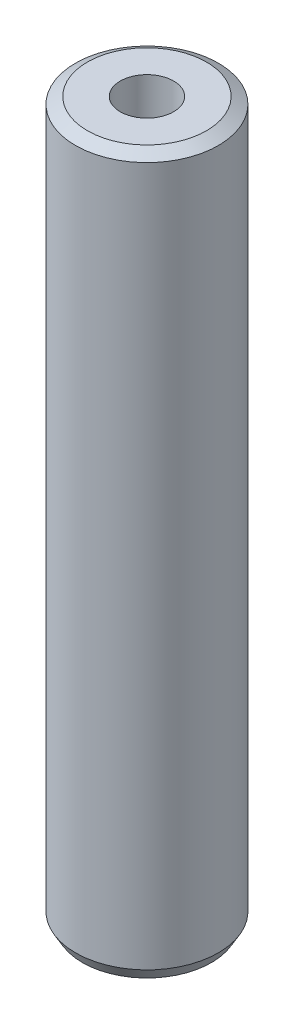
ISO-10303-21;
HEADER;
FILE_DESCRIPTION(('STEP AP214'),'2;1');
FILE_NAME('part.step','',(''),(''),'','','');
FILE_SCHEMA(('AUTOMOTIVE_DESIGN { 1 0 10303 214 1 1 1 1 }'));
ENDSEC;
DATA;
#1=APPLICATION_CONTEXT('core data for automotive mechanical design processes');
#2=APPLICATION_PROTOCOL_DEFINITION('international standard','automotive_design',2000,#1);
#3=PRODUCT_CONTEXT('',#1,'mechanical');
#4=PRODUCT('Part','Part','',(#3));
#5=PRODUCT_RELATED_PRODUCT_CATEGORY('part','',(#4));
#6=PRODUCT_DEFINITION_FORMATION('','',#4);
#7=PRODUCT_DEFINITION_CONTEXT('part definition',#1,'design');
#8=PRODUCT_DEFINITION('design','',#6,#7);
#9=PRODUCT_DEFINITION_SHAPE('','',#8);
#10=(LENGTH_UNIT() NAMED_UNIT(*) SI_UNIT(.MILLI.,.METRE.));
#11=(NAMED_UNIT(*) PLANE_ANGLE_UNIT() SI_UNIT($,.RADIAN.));
#12=(NAMED_UNIT(*) SI_UNIT($,.STERADIAN.) SOLID_ANGLE_UNIT());
#13=UNCERTAINTY_MEASURE_WITH_UNIT(LENGTH_MEASURE(1.E-05),#10,'distance_accuracy_value','');
#14=(GEOMETRIC_REPRESENTATION_CONTEXT(3) GLOBAL_UNCERTAINTY_ASSIGNED_CONTEXT((#13)) GLOBAL_UNIT_ASSIGNED_CONTEXT((#10,
#11,#12)) REPRESENTATION_CONTEXT('',''));
#15=CARTESIAN_POINT('',(0.,0.,0.));
#16=DIRECTION('',(0.,0.,1.));
#17=DIRECTION('',(1.,0.,0.));
#18=AXIS2_PLACEMENT_3D('',#15,#16,#17);
#19=CARTESIAN_POINT('',(0.,201.022569404492,0.));
#20=DIRECTION('',(0.,-1.,0.));
#21=DIRECTION('',(0.,0.,-1.));
#22=AXIS2_PLACEMENT_3D('',#19,#20,#21);
#23=CYLINDRICAL_SURFACE('',#22,20.);
#24=CARTESIAN_POINT('',(0.,199.100995015581,0.));
#25=DIRECTION('',(0.,1.,0.));
#26=DIRECTION('',(0.,0.,1.));
#27=AXIS2_PLACEMENT_3D('',#24,#25,#26);
#28=CIRCLE('',#27,20.);
#29=CARTESIAN_POINT('',(0.,199.100995015581,20.));
#30=VERTEX_POINT('',#29);
#31=EDGE_CURVE('E50',#30,#30,#28,.F.);
#32=ORIENTED_EDGE('',*,*,#31,.T.);
#33=EDGE_LOOP('',(#32));
#34=FACE_BOUND('',#33,.T.);
#35=CARTESIAN_POINT('',(0.,3.32826447211634,0.));
#36=DIRECTION('',(0.,1.,0.));
#37=DIRECTION('',(0.,0.,1.));
#38=AXIS2_PLACEMENT_3D('',#35,#36,#37);
#39=CIRCLE('',#38,20.);
#40=CARTESIAN_POINT('',(0.,3.32826447211634,20.));
#41=VERTEX_POINT('',#40);
#42=EDGE_CURVE('E51',#41,#41,#39,.T.);
#43=ORIENTED_EDGE('',*,*,#42,.T.);
#44=EDGE_LOOP('',(#43));
#45=FACE_BOUND('',#44,.T.);
#46=ADVANCED_FACE('F39',(#34,#45),#23,.T.);
#47=CARTESIAN_POINT('',(0.,201.022569404492,0.));
#48=DIRECTION('',(0.,1.,0.));
#49=DIRECTION('',(0.,0.,1.));
#50=AXIS2_PLACEMENT_3D('',#47,#48,#49);
#51=PLANE('',#50);
#52=CARTESIAN_POINT('',(0.,201.022569404492,0.));
#53=DIRECTION('',(0.,1.,0.));
#54=DIRECTION('',(0.,0.,1.));
#55=AXIS2_PLACEMENT_3D('',#52,#53,#54);
#56=CIRCLE('',#55,16.6717355278836);
#57=CARTESIAN_POINT('',(0.,201.022569404492,16.6717355278836));
#58=VERTEX_POINT('',#57);
#59=EDGE_CURVE('E54',#58,#58,#56,.T.);
#60=ORIENTED_EDGE('',*,*,#59,.T.);
#61=EDGE_LOOP('',(#60));
#62=FACE_BOUND('',#61,.T.);
#63=CARTESIAN_POINT('',(0.,201.022569404492,0.));
#64=DIRECTION('',(0.,1.,0.));
#65=DIRECTION('',(0.,0.,1.));
#66=AXIS2_PLACEMENT_3D('',#63,#64,#65);
#67=CIRCLE('',#66,7.47015795522623);
#68=CARTESIAN_POINT('',(0.,201.022569404492,7.47015795522623));
#69=VERTEX_POINT('',#68);
#70=EDGE_CURVE('E58',#69,#69,#67,.T.);
#71=ORIENTED_EDGE('',*,*,#70,.F.);
#72=EDGE_LOOP('',(#71));
#73=FACE_BOUND('',#72,.T.);
#74=ADVANCED_FACE('F69',(#62,#73),#51,.T.);
#75=CARTESIAN_POINT('',(0.,0.,0.));
#76=DIRECTION('',(0.,1.,0.));
#77=DIRECTION('',(0.,0.,1.));
#78=AXIS2_PLACEMENT_3D('',#75,#76,#77);
#79=PLANE('',#78);
#80=CARTESIAN_POINT('',(0.,0.,0.));
#81=DIRECTION('',(0.,1.,0.));
#82=DIRECTION('',(0.,0.,1.));
#83=AXIS2_PLACEMENT_3D('',#80,#81,#82);
#84=CIRCLE('',#83,18.0784256110893);
#85=CARTESIAN_POINT('',(0.,0.,18.0784256110893));
#86=VERTEX_POINT('',#85);
#87=EDGE_CURVE('E10',#86,#86,#84,.F.);
#88=ORIENTED_EDGE('',*,*,#87,.T.);
#89=EDGE_LOOP('',(#88));
#90=FACE_BOUND('',#89,.T.);
#91=CARTESIAN_POINT('',(0.,0.,0.));
#92=DIRECTION('',(0.,1.,0.));
#93=DIRECTION('',(0.,0.,1.));
#94=AXIS2_PLACEMENT_3D('',#91,#92,#93);
#95=CIRCLE('',#94,7.47015795522623);
#96=CARTESIAN_POINT('',(0.,0.,7.47015795522623));
#97=VERTEX_POINT('',#96);
#98=EDGE_CURVE('E63',#97,#97,#95,.T.);
#99=ORIENTED_EDGE('',*,*,#98,.T.);
#100=EDGE_LOOP('',(#99));
#101=FACE_BOUND('',#100,.T.);
#102=ADVANCED_FACE('F75',(#90,#101),#79,.F.);
#103=CARTESIAN_POINT('',(0.,201.022569404492,0.));
#104=DIRECTION('',(0.,-1.,0.));
#105=DIRECTION('',(0.,0.,-1.));
#106=AXIS2_PLACEMENT_3D('',#103,#104,#105);
#107=CYLINDRICAL_SURFACE('',#106,7.47015795522623);
#108=ORIENTED_EDGE('',*,*,#70,.T.);
#109=EDGE_LOOP('',(#108));
#110=FACE_BOUND('',#109,.T.);
#111=ORIENTED_EDGE('',*,*,#98,.F.);
#112=EDGE_LOOP('',(#111));
#113=FACE_BOUND('',#112,.T.);
#114=ADVANCED_FACE('F70',(#110,#113),#107,.F.);
#115=CARTESIAN_POINT('',(0.,201.022569404492,0.));
#116=DIRECTION('',(0.,-1.,0.));
#117=DIRECTION('',(0.,0.,-1.));
#118=AXIS2_PLACEMENT_3D('',#115,#116,#117);
#119=CONICAL_SURFACE('',#118,16.6717355278836,1.0471975511966);
#120=ORIENTED_EDGE('',*,*,#31,.F.);
#121=EDGE_LOOP('',(#120));
#122=FACE_BOUND('',#121,.T.);
#123=ORIENTED_EDGE('',*,*,#59,.F.);
#124=EDGE_LOOP('',(#123));
#125=FACE_BOUND('',#124,.T.);
#126=ADVANCED_FACE('F81',(#122,#125),#119,.T.);
#127=CARTESIAN_POINT('',(0.,3.32826447211634,0.));
#128=DIRECTION('',(0.,1.,0.));
#129=DIRECTION('',(0.,0.,1.));
#130=AXIS2_PLACEMENT_3D('',#127,#128,#129);
#131=CONICAL_SURFACE('',#130,20.,0.523598775598304);
#132=ORIENTED_EDGE('',*,*,#87,.F.);
#133=EDGE_LOOP('',(#132));
#134=FACE_BOUND('',#133,.T.);
#135=ORIENTED_EDGE('',*,*,#42,.F.);
#136=EDGE_LOOP('',(#135));
#137=FACE_BOUND('',#136,.T.);
#138=ADVANCED_FACE('F45',(#134,#137),#131,.T.);
#139=CLOSED_SHELL('',(#46,#74,#102,#114,#126,#138));
#140=MANIFOLD_SOLID_BREP('B2',#139);
#141=ADVANCED_BREP_SHAPE_REPRESENTATION('',(#18,#140),#14);
#142=SHAPE_DEFINITION_REPRESENTATION(#9,#141);
ENDSEC;
END-ISO-10303-21;
